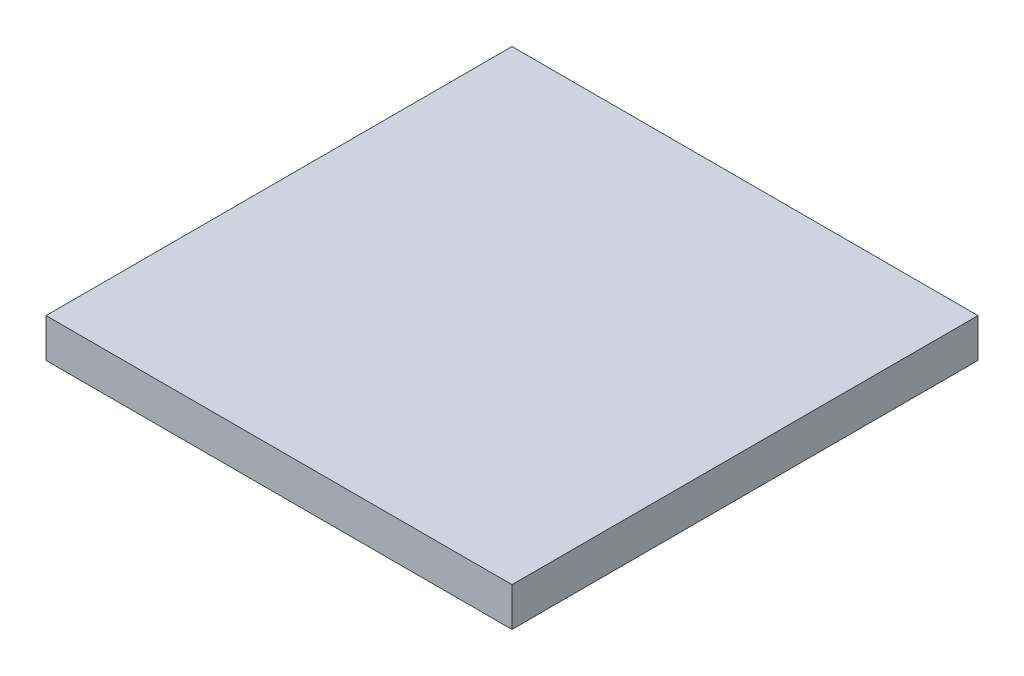
ISO-10303-21;
HEADER;
FILE_DESCRIPTION(('STEP AP214'),'2;1');
FILE_NAME('part.step','',(''),(''),'','','');
FILE_SCHEMA(('AUTOMOTIVE_DESIGN { 1 0 10303 214 1 1 1 1 }'));
ENDSEC;
DATA;
#1=APPLICATION_CONTEXT('core data for automotive mechanical design processes');
#2=APPLICATION_PROTOCOL_DEFINITION('international standard','automotive_design',2000,#1);
#3=PRODUCT_CONTEXT('',#1,'mechanical');
#4=PRODUCT('Part','Part','',(#3));
#5=PRODUCT_RELATED_PRODUCT_CATEGORY('part','',(#4));
#6=PRODUCT_DEFINITION_FORMATION('','',#4);
#7=PRODUCT_DEFINITION_CONTEXT('part definition',#1,'design');
#8=PRODUCT_DEFINITION('design','',#6,#7);
#9=PRODUCT_DEFINITION_SHAPE('','',#8);
#10=(LENGTH_UNIT() NAMED_UNIT(*) SI_UNIT(.MILLI.,.METRE.));
#11=(NAMED_UNIT(*) PLANE_ANGLE_UNIT() SI_UNIT($,.RADIAN.));
#12=(NAMED_UNIT(*) SI_UNIT($,.STERADIAN.) SOLID_ANGLE_UNIT());
#13=UNCERTAINTY_MEASURE_WITH_UNIT(LENGTH_MEASURE(1.E-05),#10,'distance_accuracy_value','');
#14=(GEOMETRIC_REPRESENTATION_CONTEXT(3) GLOBAL_UNCERTAINTY_ASSIGNED_CONTEXT((#13)) GLOBAL_UNIT_ASSIGNED_CONTEXT((#10,
#11,#12)) REPRESENTATION_CONTEXT('',''));
#15=CARTESIAN_POINT('',(0.,0.,0.));
#16=DIRECTION('',(0.,0.,1.));
#17=DIRECTION('',(1.,0.,0.));
#18=AXIS2_PLACEMENT_3D('',#15,#16,#17);
#19=CARTESIAN_POINT('',(0.,0.,0.));
#20=DIRECTION('',(0.,1.,0.));
#21=DIRECTION('',(0.,0.,1.));
#22=AXIS2_PLACEMENT_3D('',#19,#20,#21);
#23=PLANE('',#22);
#24=DIRECTION('',(0.,0.,1.));
#25=VECTOR('',#24,1.);
#26=CARTESIAN_POINT('',(-6.,0.,-6.));
#27=LINE('',#26,#25);
#28=CARTESIAN_POINT('',(-6.,0.,-6.));
#29=VERTEX_POINT('',#28);
#30=CARTESIAN_POINT('',(-6.,0.,6.));
#31=VERTEX_POINT('',#30);
#32=EDGE_CURVE('E79',#29,#31,#27,.T.);
#33=ORIENTED_EDGE('',*,*,#32,.F.);
#34=DIRECTION('',(-1.,0.,0.));
#35=VECTOR('',#34,1.);
#36=CARTESIAN_POINT('',(6.,0.,-6.));
#37=LINE('',#36,#35);
#38=CARTESIAN_POINT('',(6.,0.,-6.));
#39=VERTEX_POINT('',#38);
#40=EDGE_CURVE('E55',#39,#29,#37,.T.);
#41=ORIENTED_EDGE('',*,*,#40,.F.);
#42=DIRECTION('',(0.,0.,-1.));
#43=VECTOR('',#42,1.);
#44=CARTESIAN_POINT('',(6.,0.,6.));
#45=LINE('',#44,#43);
#46=CARTESIAN_POINT('',(6.,0.,6.));
#47=VERTEX_POINT('',#46);
#48=EDGE_CURVE('E57',#47,#39,#45,.T.);
#49=ORIENTED_EDGE('',*,*,#48,.F.);
#50=DIRECTION('',(1.,0.,0.));
#51=VECTOR('',#50,1.);
#52=CARTESIAN_POINT('',(-6.,0.,6.));
#53=LINE('',#52,#51);
#54=EDGE_CURVE('E20',#31,#47,#53,.T.);
#55=ORIENTED_EDGE('',*,*,#54,.F.);
#56=EDGE_LOOP('',(#33,#41,#49,#55));
#57=FACE_BOUND('',#56,.T.);
#58=ADVANCED_FACE('F17',(#57),#23,.F.);
#59=CARTESIAN_POINT('',(-6.,0.,6.));
#60=DIRECTION('',(0.,0.,1.));
#61=DIRECTION('',(1.,0.,0.));
#62=AXIS2_PLACEMENT_3D('',#59,#60,#61);
#63=PLANE('',#62);
#64=DIRECTION('',(1.,0.,0.));
#65=VECTOR('',#64,1.);
#66=CARTESIAN_POINT('',(0.,1.,6.));
#67=LINE('',#66,#65);
#68=CARTESIAN_POINT('',(-6.,1.,6.));
#69=VERTEX_POINT('',#68);
#70=CARTESIAN_POINT('',(6.,1.,6.));
#71=VERTEX_POINT('',#70);
#72=EDGE_CURVE('E83',#69,#71,#67,.T.);
#73=ORIENTED_EDGE('',*,*,#72,.F.);
#74=DIRECTION('',(0.,1.,0.));
#75=VECTOR('',#74,1.);
#76=CARTESIAN_POINT('',(-6.,0.,6.));
#77=LINE('',#76,#75);
#78=EDGE_CURVE('E68',#31,#69,#77,.T.);
#79=ORIENTED_EDGE('',*,*,#78,.F.);
#80=ORIENTED_EDGE('',*,*,#54,.T.);
#81=DIRECTION('',(0.,1.,0.));
#82=VECTOR('',#81,1.);
#83=CARTESIAN_POINT('',(6.,0.,6.));
#84=LINE('',#83,#82);
#85=EDGE_CURVE('E63',#71,#47,#84,.F.);
#86=ORIENTED_EDGE('',*,*,#85,.F.);
#87=EDGE_LOOP('',(#73,#79,#80,#86));
#88=FACE_BOUND('',#87,.T.);
#89=ADVANCED_FACE('F65',(#88),#63,.T.);
#90=CARTESIAN_POINT('',(6.,0.,6.));
#91=DIRECTION('',(1.,0.,0.));
#92=DIRECTION('',(0.,0.,-1.));
#93=AXIS2_PLACEMENT_3D('',#90,#91,#92);
#94=PLANE('',#93);
#95=DIRECTION('',(0.,0.,1.));
#96=VECTOR('',#95,1.);
#97=CARTESIAN_POINT('',(6.,1.,0.));
#98=LINE('',#97,#96);
#99=CARTESIAN_POINT('',(6.,1.,-6.));
#100=VERTEX_POINT('',#99);
#101=EDGE_CURVE('E72',#71,#100,#98,.F.);
#102=ORIENTED_EDGE('',*,*,#101,.F.);
#103=ORIENTED_EDGE('',*,*,#85,.T.);
#104=ORIENTED_EDGE('',*,*,#48,.T.);
#105=DIRECTION('',(0.,1.,0.));
#106=VECTOR('',#105,1.);
#107=CARTESIAN_POINT('',(6.,0.,-6.));
#108=LINE('',#107,#106);
#109=EDGE_CURVE('E75',#100,#39,#108,.F.);
#110=ORIENTED_EDGE('',*,*,#109,.F.);
#111=EDGE_LOOP('',(#102,#103,#104,#110));
#112=FACE_BOUND('',#111,.T.);
#113=ADVANCED_FACE('F70',(#112),#94,.T.);
#114=CARTESIAN_POINT('',(6.,0.,-6.));
#115=DIRECTION('',(0.,0.,-1.));
#116=DIRECTION('',(-1.,0.,0.));
#117=AXIS2_PLACEMENT_3D('',#114,#115,#116);
#118=PLANE('',#117);
#119=DIRECTION('',(1.,0.,0.));
#120=VECTOR('',#119,1.);
#121=CARTESIAN_POINT('',(0.,1.,-6.));
#122=LINE('',#121,#120);
#123=CARTESIAN_POINT('',(-6.,1.,-6.));
#124=VERTEX_POINT('',#123);
#125=EDGE_CURVE('E26',#100,#124,#122,.F.);
#126=ORIENTED_EDGE('',*,*,#125,.F.);
#127=ORIENTED_EDGE('',*,*,#109,.T.);
#128=ORIENTED_EDGE('',*,*,#40,.T.);
#129=DIRECTION('',(0.,1.,0.));
#130=VECTOR('',#129,1.);
#131=CARTESIAN_POINT('',(-6.,0.,-6.));
#132=LINE('',#131,#130);
#133=EDGE_CURVE('E35',#124,#29,#132,.F.);
#134=ORIENTED_EDGE('',*,*,#133,.F.);
#135=EDGE_LOOP('',(#126,#127,#128,#134));
#136=FACE_BOUND('',#135,.T.);
#137=ADVANCED_FACE('F89',(#136),#118,.T.);
#138=CARTESIAN_POINT('',(-6.,0.,-6.));
#139=DIRECTION('',(-1.,0.,0.));
#140=DIRECTION('',(0.,0.,1.));
#141=AXIS2_PLACEMENT_3D('',#138,#139,#140);
#142=PLANE('',#141);
#143=DIRECTION('',(0.,0.,1.));
#144=VECTOR('',#143,1.);
#145=CARTESIAN_POINT('',(-6.,1.,0.));
#146=LINE('',#145,#144);
#147=EDGE_CURVE('E11',#124,#69,#146,.T.);
#148=ORIENTED_EDGE('',*,*,#147,.F.);
#149=ORIENTED_EDGE('',*,*,#133,.T.);
#150=ORIENTED_EDGE('',*,*,#32,.T.);
#151=ORIENTED_EDGE('',*,*,#78,.T.);
#152=EDGE_LOOP('',(#148,#149,#150,#151));
#153=FACE_BOUND('',#152,.T.);
#154=ADVANCED_FACE('F91',(#153),#142,.T.);
#155=CARTESIAN_POINT('',(0.,1.,0.));
#156=DIRECTION('',(0.,1.,0.));
#157=DIRECTION('',(0.,0.,1.));
#158=AXIS2_PLACEMENT_3D('',#155,#156,#157);
#159=PLANE('',#158);
#160=ORIENTED_EDGE('',*,*,#125,.T.);
#161=ORIENTED_EDGE('',*,*,#147,.T.);
#162=ORIENTED_EDGE('',*,*,#72,.T.);
#163=ORIENTED_EDGE('',*,*,#101,.T.);
#164=EDGE_LOOP('',(#160,#161,#162,#163));
#165=FACE_BOUND('',#164,.T.);
#166=ADVANCED_FACE('F88',(#165),#159,.T.);
#167=CLOSED_SHELL('',(#58,#89,#113,#137,#154,#166));
#168=MANIFOLD_SOLID_BREP('B1',#167);
#169=ADVANCED_BREP_SHAPE_REPRESENTATION('',(#18,#168),#14);
#170=SHAPE_DEFINITION_REPRESENTATION(#9,#169);
ENDSEC;
END-ISO-10303-21;
